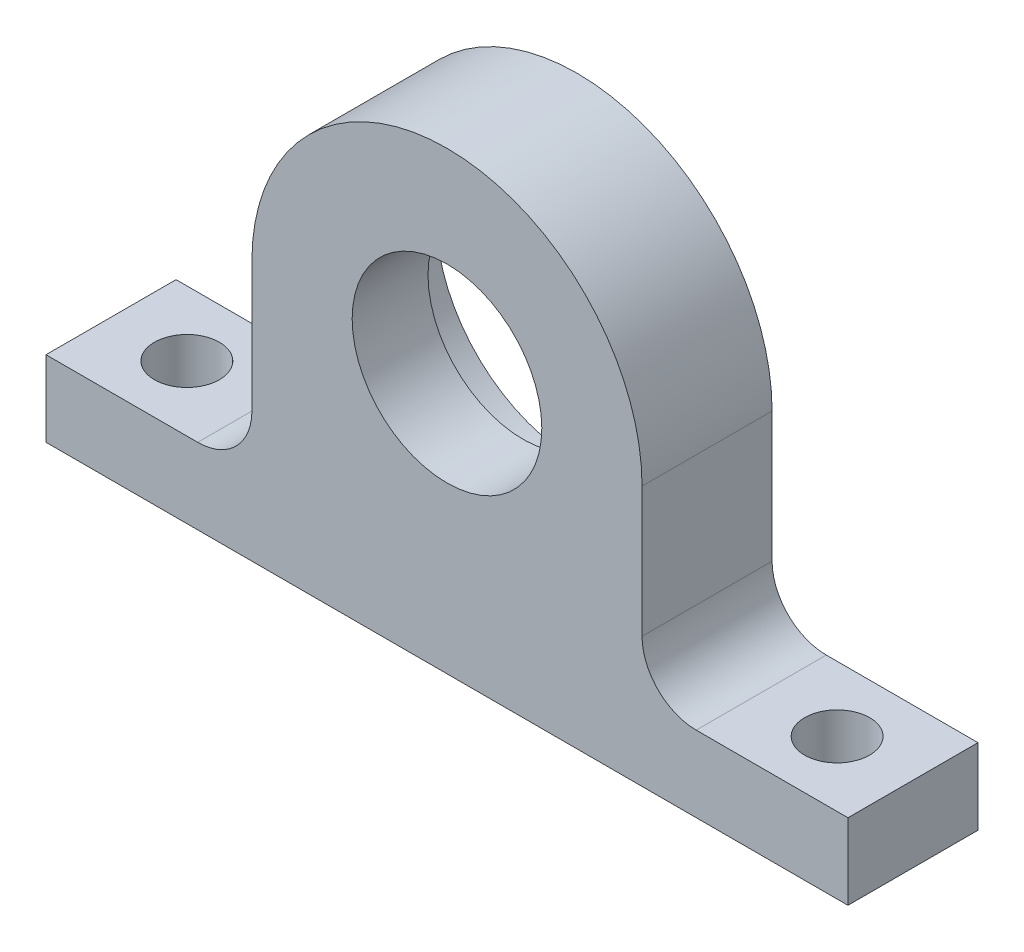
ISO-10303-21;
HEADER;
FILE_DESCRIPTION(('STEP AP214'),'2;1');
FILE_NAME('part.step','',(''),(''),'','','');
FILE_SCHEMA(('AUTOMOTIVE_DESIGN { 1 0 10303 214 1 1 1 1 }'));
ENDSEC;
DATA;
#1=APPLICATION_CONTEXT('core data for automotive mechanical design processes');
#2=APPLICATION_PROTOCOL_DEFINITION('international standard','automotive_design',2000,#1);
#3=PRODUCT_CONTEXT('',#1,'mechanical');
#4=PRODUCT('Part','Part','',(#3));
#5=PRODUCT_RELATED_PRODUCT_CATEGORY('part','',(#4));
#6=PRODUCT_DEFINITION_FORMATION('','',#4);
#7=PRODUCT_DEFINITION_CONTEXT('part definition',#1,'design');
#8=PRODUCT_DEFINITION('design','',#6,#7);
#9=PRODUCT_DEFINITION_SHAPE('','',#8);
#10=(LENGTH_UNIT() NAMED_UNIT(*) SI_UNIT(.MILLI.,.METRE.));
#11=(NAMED_UNIT(*) PLANE_ANGLE_UNIT() SI_UNIT($,.RADIAN.));
#12=(NAMED_UNIT(*) SI_UNIT($,.STERADIAN.) SOLID_ANGLE_UNIT());
#13=UNCERTAINTY_MEASURE_WITH_UNIT(LENGTH_MEASURE(1.E-05),#10,'distance_accuracy_value','');
#14=(GEOMETRIC_REPRESENTATION_CONTEXT(3) GLOBAL_UNCERTAINTY_ASSIGNED_CONTEXT((#13)) GLOBAL_UNIT_ASSIGNED_CONTEXT((#10,
#11,#12)) REPRESENTATION_CONTEXT('',''));
#15=CARTESIAN_POINT('',(0.,0.,0.));
#16=DIRECTION('',(0.,0.,1.));
#17=DIRECTION('',(1.,0.,0.));
#18=AXIS2_PLACEMENT_3D('',#15,#16,#17);
#19=CARTESIAN_POINT('',(0.,0.,12.));
#20=DIRECTION('',(0.,0.,-1.));
#21=DIRECTION('',(-1.,0.,0.));
#22=AXIS2_PLACEMENT_3D('',#19,#20,#21);
#23=CYLINDRICAL_SURFACE('',#22,18.);
#24=CARTESIAN_POINT('',(0.,0.,12.));
#25=DIRECTION('',(0.,0.,1.));
#26=DIRECTION('',(1.,0.,0.));
#27=AXIS2_PLACEMENT_3D('',#24,#25,#26);
#28=CIRCLE('',#27,18.);
#29=CARTESIAN_POINT('',(18.,-1.28369537222284E-13,12.));
#30=VERTEX_POINT('',#29);
#31=CARTESIAN_POINT('',(-18.,-1.31838984174237E-13,12.));
#32=VERTEX_POINT('',#31);
#33=EDGE_CURVE('E122',#30,#32,#28,.T.);
#34=ORIENTED_EDGE('',*,*,#33,.F.);
#35=DIRECTION('',(0.,0.,-1.));
#36=VECTOR('',#35,1.);
#37=CARTESIAN_POINT('',(18.,-1.25693328198353E-13,12.));
#38=LINE('',#37,#36);
#39=CARTESIAN_POINT('',(18.,-1.28369537222284E-13,0.));
#40=VERTEX_POINT('',#39);
#41=EDGE_CURVE('E193',#30,#40,#38,.T.);
#42=ORIENTED_EDGE('',*,*,#41,.T.);
#43=CARTESIAN_POINT('',(0.,0.,0.));
#44=DIRECTION('',(0.,0.,1.));
#45=DIRECTION('',(1.,0.,0.));
#46=AXIS2_PLACEMENT_3D('',#43,#44,#45);
#47=CIRCLE('',#46,18.);
#48=CARTESIAN_POINT('',(-18.,-1.31838984174237E-13,0.));
#49=VERTEX_POINT('',#48);
#50=EDGE_CURVE('E226',#40,#49,#47,.T.);
#51=ORIENTED_EDGE('',*,*,#50,.T.);
#52=DIRECTION('',(0.,0.,-1.));
#53=VECTOR('',#52,1.);
#54=CARTESIAN_POINT('',(-18.,-1.25693328198353E-13,12.));
#55=LINE('',#54,#53);
#56=EDGE_CURVE('E192',#32,#49,#55,.T.);
#57=ORIENTED_EDGE('',*,*,#56,.F.);
#58=EDGE_LOOP('',(#34,#42,#51,#57));
#59=FACE_BOUND('',#58,.T.);
#60=ADVANCED_FACE('F41',(#59),#23,.T.);
#61=CARTESIAN_POINT('',(0.,0.,12.));
#62=DIRECTION('',(0.,0.,-1.));
#63=DIRECTION('',(-1.,0.,0.));
#64=AXIS2_PLACEMENT_3D('',#61,#62,#63);
#65=CYLINDRICAL_SURFACE('',#64,8.75);
#66=CARTESIAN_POINT('',(0.,0.,12.));
#67=DIRECTION('',(0.,0.,1.));
#68=DIRECTION('',(1.,0.,0.));
#69=AXIS2_PLACEMENT_3D('',#66,#67,#68);
#70=CIRCLE('',#69,8.75);
#71=CARTESIAN_POINT('',(8.75,0.,12.));
#72=VERTEX_POINT('',#71);
#73=EDGE_CURVE('E214',#72,#72,#70,.T.);
#74=ORIENTED_EDGE('',*,*,#73,.T.);
#75=EDGE_LOOP('',(#74));
#76=FACE_BOUND('',#75,.T.);
#77=CARTESIAN_POINT('',(0.,0.,5.));
#78=DIRECTION('',(0.,0.,-1.));
#79=DIRECTION('',(-1.,0.,0.));
#80=AXIS2_PLACEMENT_3D('',#77,#78,#79);
#81=CIRCLE('',#80,8.75);
#82=CARTESIAN_POINT('',(-8.75,0.,5.));
#83=VERTEX_POINT('',#82);
#84=EDGE_CURVE('E150',#83,#83,#81,.T.);
#85=ORIENTED_EDGE('',*,*,#84,.T.);
#86=EDGE_LOOP('',(#85));
#87=FACE_BOUND('',#86,.T.);
#88=ADVANCED_FACE('F251',(#76,#87),#65,.F.);
#89=CARTESIAN_POINT('',(0.,0.,12.));
#90=DIRECTION('',(0.,0.,1.));
#91=DIRECTION('',(1.,0.,0.));
#92=AXIS2_PLACEMENT_3D('',#89,#90,#91);
#93=PLANE('',#92);
#94=DIRECTION('',(0.,-1.,0.));
#95=VECTOR('',#94,1.);
#96=CARTESIAN_POINT('',(18.,-1.25693328198353E-13,12.));
#97=LINE('',#96,#95);
#98=CARTESIAN_POINT('',(18.,-12.,12.));
#99=VERTEX_POINT('',#98);
#100=EDGE_CURVE('E196',#30,#99,#97,.T.);
#101=ORIENTED_EDGE('',*,*,#100,.F.);
#102=ORIENTED_EDGE('',*,*,#33,.T.);
#103=DIRECTION('',(0.,1.,0.));
#104=VECTOR('',#103,1.);
#105=CARTESIAN_POINT('',(-18.,-1.25693328198353E-13,12.));
#106=LINE('',#105,#104);
#107=CARTESIAN_POINT('',(-18.,-12.,12.));
#108=VERTEX_POINT('',#107);
#109=EDGE_CURVE('E169',#108,#32,#106,.T.);
#110=ORIENTED_EDGE('',*,*,#109,.F.);
#111=CARTESIAN_POINT('',(-23.,-12.,12.));
#112=DIRECTION('',(0.,0.,1.));
#113=DIRECTION('',(1.,0.,0.));
#114=AXIS2_PLACEMENT_3D('',#111,#112,#113);
#115=CIRCLE('',#114,5.);
#116=CARTESIAN_POINT('',(-23.,-17.,12.));
#117=VERTEX_POINT('',#116);
#118=EDGE_CURVE('E162',#108,#117,#115,.F.);
#119=ORIENTED_EDGE('',*,*,#118,.T.);
#120=DIRECTION('',(-1.,0.,0.));
#121=VECTOR('',#120,1.);
#122=CARTESIAN_POINT('',(-5.91607978309961,-17.,12.));
#123=LINE('',#122,#121);
#124=CARTESIAN_POINT('',(-37.,-17.,12.));
#125=VERTEX_POINT('',#124);
#126=EDGE_CURVE('E166',#117,#125,#123,.T.);
#127=ORIENTED_EDGE('',*,*,#126,.T.);
#128=DIRECTION('',(0.,-1.,0.));
#129=VECTOR('',#128,1.);
#130=CARTESIAN_POINT('',(-37.,-17.,12.));
#131=LINE('',#130,#129);
#132=CARTESIAN_POINT('',(-37.,-24.,12.));
#133=VERTEX_POINT('',#132);
#134=EDGE_CURVE('E177',#125,#133,#131,.T.);
#135=ORIENTED_EDGE('',*,*,#134,.T.);
#136=DIRECTION('',(1.,0.,0.));
#137=VECTOR('',#136,1.);
#138=CARTESIAN_POINT('',(-37.,-24.,12.));
#139=LINE('',#138,#137);
#140=CARTESIAN_POINT('',(37.,-24.,12.));
#141=VERTEX_POINT('',#140);
#142=EDGE_CURVE('E130',#133,#141,#139,.T.);
#143=ORIENTED_EDGE('',*,*,#142,.T.);
#144=DIRECTION('',(0.,1.,0.));
#145=VECTOR('',#144,1.);
#146=CARTESIAN_POINT('',(37.,-17.,12.));
#147=LINE('',#146,#145);
#148=CARTESIAN_POINT('',(37.,-17.,12.));
#149=VERTEX_POINT('',#148);
#150=EDGE_CURVE('E123',#141,#149,#147,.T.);
#151=ORIENTED_EDGE('',*,*,#150,.T.);
#152=DIRECTION('',(-1.,0.,0.));
#153=VECTOR('',#152,1.);
#154=CARTESIAN_POINT('',(5.91607978309961,-17.,12.));
#155=LINE('',#154,#153);
#156=CARTESIAN_POINT('',(23.,-17.,12.));
#157=VERTEX_POINT('',#156);
#158=EDGE_CURVE('E114',#149,#157,#155,.T.);
#159=ORIENTED_EDGE('',*,*,#158,.T.);
#160=CARTESIAN_POINT('',(23.,-12.,12.));
#161=DIRECTION('',(0.,0.,1.));
#162=DIRECTION('',(1.,0.,0.));
#163=AXIS2_PLACEMENT_3D('',#160,#161,#162);
#164=CIRCLE('',#163,5.);
#165=EDGE_CURVE('E11',#157,#99,#164,.F.);
#166=ORIENTED_EDGE('',*,*,#165,.T.);
#167=EDGE_LOOP('',(#101,#102,#110,#119,#127,#135,#143,#151,#159,#166));
#168=FACE_BOUND('',#167,.T.);
#169=ORIENTED_EDGE('',*,*,#73,.F.);
#170=EDGE_LOOP('',(#169));
#171=FACE_BOUND('',#170,.T.);
#172=ADVANCED_FACE('F127',(#168,#171),#93,.T.);
#173=CARTESIAN_POINT('',(0.,0.,0.));
#174=DIRECTION('',(0.,0.,1.));
#175=DIRECTION('',(1.,0.,0.));
#176=AXIS2_PLACEMENT_3D('',#173,#174,#175);
#177=PLANE('',#176);
#178=ORIENTED_EDGE('',*,*,#50,.F.);
#179=DIRECTION('',(0.,-1.,0.));
#180=VECTOR('',#179,1.);
#181=CARTESIAN_POINT('',(18.,-1.25693328198353E-13,0.));
#182=LINE('',#181,#180);
#183=CARTESIAN_POINT('',(18.,-12.,0.));
#184=VERTEX_POINT('',#183);
#185=EDGE_CURVE('E246',#40,#184,#182,.T.);
#186=ORIENTED_EDGE('',*,*,#185,.T.);
#187=CARTESIAN_POINT('',(23.,-12.,0.));
#188=DIRECTION('',(0.,0.,1.));
#189=DIRECTION('',(1.,0.,0.));
#190=AXIS2_PLACEMENT_3D('',#187,#188,#189);
#191=CIRCLE('',#190,5.);
#192=CARTESIAN_POINT('',(23.,-17.,0.));
#193=VERTEX_POINT('',#192);
#194=EDGE_CURVE('E49',#184,#193,#191,.T.);
#195=ORIENTED_EDGE('',*,*,#194,.T.);
#196=DIRECTION('',(-1.,0.,0.));
#197=VECTOR('',#196,1.);
#198=CARTESIAN_POINT('',(5.91607978309961,-17.,0.));
#199=LINE('',#198,#197);
#200=CARTESIAN_POINT('',(37.,-17.,0.));
#201=VERTEX_POINT('',#200);
#202=EDGE_CURVE('E224',#201,#193,#199,.T.);
#203=ORIENTED_EDGE('',*,*,#202,.F.);
#204=DIRECTION('',(0.,1.,0.));
#205=VECTOR('',#204,1.);
#206=CARTESIAN_POINT('',(37.,-17.,0.));
#207=LINE('',#206,#205);
#208=CARTESIAN_POINT('',(37.,-24.,0.));
#209=VERTEX_POINT('',#208);
#210=EDGE_CURVE('E138',#209,#201,#207,.T.);
#211=ORIENTED_EDGE('',*,*,#210,.F.);
#212=DIRECTION('',(1.,0.,0.));
#213=VECTOR('',#212,1.);
#214=CARTESIAN_POINT('',(37.,-24.,0.));
#215=LINE('',#214,#213);
#216=CARTESIAN_POINT('',(-37.,-24.,0.));
#217=VERTEX_POINT('',#216);
#218=EDGE_CURVE('E134',#217,#209,#215,.T.);
#219=ORIENTED_EDGE('',*,*,#218,.F.);
#220=DIRECTION('',(0.,-1.,0.));
#221=VECTOR('',#220,1.);
#222=CARTESIAN_POINT('',(-37.,-17.,0.));
#223=LINE('',#222,#221);
#224=CARTESIAN_POINT('',(-37.,-17.,0.));
#225=VERTEX_POINT('',#224);
#226=EDGE_CURVE('E229',#225,#217,#223,.T.);
#227=ORIENTED_EDGE('',*,*,#226,.F.);
#228=DIRECTION('',(-1.,0.,0.));
#229=VECTOR('',#228,1.);
#230=CARTESIAN_POINT('',(-5.91607978309961,-17.,0.));
#231=LINE('',#230,#229);
#232=CARTESIAN_POINT('',(-23.,-17.,0.));
#233=VERTEX_POINT('',#232);
#234=EDGE_CURVE('E187',#233,#225,#231,.T.);
#235=ORIENTED_EDGE('',*,*,#234,.F.);
#236=CARTESIAN_POINT('',(-23.,-12.,0.));
#237=DIRECTION('',(0.,0.,1.));
#238=DIRECTION('',(1.,0.,0.));
#239=AXIS2_PLACEMENT_3D('',#236,#237,#238);
#240=CIRCLE('',#239,5.);
#241=CARTESIAN_POINT('',(-18.,-12.,0.));
#242=VERTEX_POINT('',#241);
#243=EDGE_CURVE('E160',#233,#242,#240,.T.);
#244=ORIENTED_EDGE('',*,*,#243,.T.);
#245=DIRECTION('',(0.,1.,0.));
#246=VECTOR('',#245,1.);
#247=CARTESIAN_POINT('',(-18.,-1.25693328198353E-13,0.));
#248=LINE('',#247,#246);
#249=EDGE_CURVE('E184',#242,#49,#248,.T.);
#250=ORIENTED_EDGE('',*,*,#249,.T.);
#251=EDGE_LOOP('',(#178,#186,#195,#203,#211,#219,#227,#235,#244,#250));
#252=FACE_BOUND('',#251,.T.);
#253=CARTESIAN_POINT('',(0.,0.,0.));
#254=DIRECTION('',(0.,0.,-1.));
#255=DIRECTION('',(-1.,0.,0.));
#256=AXIS2_PLACEMENT_3D('',#253,#254,#255);
#257=CIRCLE('',#256,13.);
#258=CARTESIAN_POINT('',(-13.,0.,0.));
#259=VERTEX_POINT('',#258);
#260=EDGE_CURVE('E200',#259,#259,#257,.T.);
#261=ORIENTED_EDGE('',*,*,#260,.F.);
#262=EDGE_LOOP('',(#261));
#263=FACE_BOUND('',#262,.T.);
#264=ADVANCED_FACE('F182',(#252,#263),#177,.F.);
#265=CARTESIAN_POINT('',(37.,-17.,12.));
#266=DIRECTION('',(-1.,0.,0.));
#267=DIRECTION('',(0.,-1.,0.));
#268=AXIS2_PLACEMENT_3D('',#265,#266,#267);
#269=PLANE('',#268);
#270=ORIENTED_EDGE('',*,*,#210,.T.);
#271=DIRECTION('',(0.,0.,-1.));
#272=VECTOR('',#271,1.);
#273=CARTESIAN_POINT('',(37.,-17.,12.));
#274=LINE('',#273,#272);
#275=EDGE_CURVE('E118',#149,#201,#274,.T.);
#276=ORIENTED_EDGE('',*,*,#275,.F.);
#277=ORIENTED_EDGE('',*,*,#150,.F.);
#278=DIRECTION('',(0.,0.,-1.));
#279=VECTOR('',#278,1.);
#280=CARTESIAN_POINT('',(37.,-24.,12.));
#281=LINE('',#280,#279);
#282=EDGE_CURVE('E222',#141,#209,#281,.T.);
#283=ORIENTED_EDGE('',*,*,#282,.T.);
#284=EDGE_LOOP('',(#270,#276,#277,#283));
#285=FACE_BOUND('',#284,.T.);
#286=ADVANCED_FACE('F136',(#285),#269,.F.);
#287=CARTESIAN_POINT('',(5.91607978309961,-17.,12.));
#288=DIRECTION('',(0.,-1.,0.));
#289=DIRECTION('',(1.,0.,0.));
#290=AXIS2_PLACEMENT_3D('',#287,#288,#289);
#291=PLANE('',#290);
#292=CARTESIAN_POINT('',(30.,-17.,6.));
#293=DIRECTION('',(0.,1.,0.));
#294=DIRECTION('',(-1.,0.,0.));
#295=AXIS2_PLACEMENT_3D('',#292,#293,#294);
#296=CIRCLE('',#295,3.);
#297=CARTESIAN_POINT('',(27.,-17.,6.));
#298=VERTEX_POINT('',#297);
#299=EDGE_CURVE('E208',#298,#298,#296,.T.);
#300=ORIENTED_EDGE('',*,*,#299,.F.);
#301=EDGE_LOOP('',(#300));
#302=FACE_BOUND('',#301,.T.);
#303=ORIENTED_EDGE('',*,*,#202,.T.);
#304=DIRECTION('',(0.,0.,-1.));
#305=VECTOR('',#304,1.);
#306=CARTESIAN_POINT('',(23.,-17.,12.));
#307=LINE('',#306,#305);
#308=EDGE_CURVE('E56',#193,#157,#307,.F.);
#309=ORIENTED_EDGE('',*,*,#308,.T.);
#310=ORIENTED_EDGE('',*,*,#158,.F.);
#311=ORIENTED_EDGE('',*,*,#275,.T.);
#312=EDGE_LOOP('',(#303,#309,#310,#311));
#313=FACE_BOUND('',#312,.T.);
#314=ADVANCED_FACE('F116',(#302,#313),#291,.F.);
#315=CARTESIAN_POINT('',(-5.91607978309961,-17.,12.));
#316=DIRECTION('',(0.,-1.,0.));
#317=DIRECTION('',(1.,0.,0.));
#318=AXIS2_PLACEMENT_3D('',#315,#316,#317);
#319=PLANE('',#318);
#320=CARTESIAN_POINT('',(-30.,-17.,6.));
#321=DIRECTION('',(0.,1.,0.));
#322=DIRECTION('',(1.,0.,0.));
#323=AXIS2_PLACEMENT_3D('',#320,#321,#322);
#324=CIRCLE('',#323,3.);
#325=CARTESIAN_POINT('',(-27.,-17.,6.));
#326=VERTEX_POINT('',#325);
#327=EDGE_CURVE('E152',#326,#326,#324,.T.);
#328=ORIENTED_EDGE('',*,*,#327,.F.);
#329=EDGE_LOOP('',(#328));
#330=FACE_BOUND('',#329,.T.);
#331=ORIENTED_EDGE('',*,*,#126,.F.);
#332=DIRECTION('',(0.,0.,-1.));
#333=VECTOR('',#332,1.);
#334=CARTESIAN_POINT('',(-23.,-17.,12.));
#335=LINE('',#334,#333);
#336=EDGE_CURVE('E139',#117,#233,#335,.T.);
#337=ORIENTED_EDGE('',*,*,#336,.T.);
#338=ORIENTED_EDGE('',*,*,#234,.T.);
#339=DIRECTION('',(0.,0.,-1.));
#340=VECTOR('',#339,1.);
#341=CARTESIAN_POINT('',(-37.,-17.,12.));
#342=LINE('',#341,#340);
#343=EDGE_CURVE('E140',#125,#225,#342,.T.);
#344=ORIENTED_EDGE('',*,*,#343,.F.);
#345=EDGE_LOOP('',(#331,#337,#338,#344));
#346=FACE_BOUND('',#345,.T.);
#347=ADVANCED_FACE('F174',(#330,#346),#319,.F.);
#348=CARTESIAN_POINT('',(-37.,-17.,12.));
#349=DIRECTION('',(1.,0.,0.));
#350=DIRECTION('',(0.,1.,0.));
#351=AXIS2_PLACEMENT_3D('',#348,#349,#350);
#352=PLANE('',#351);
#353=ORIENTED_EDGE('',*,*,#226,.T.);
#354=DIRECTION('',(0.,0.,-1.));
#355=VECTOR('',#354,1.);
#356=CARTESIAN_POINT('',(-37.,-24.,12.));
#357=LINE('',#356,#355);
#358=EDGE_CURVE('E146',#133,#217,#357,.T.);
#359=ORIENTED_EDGE('',*,*,#358,.F.);
#360=ORIENTED_EDGE('',*,*,#134,.F.);
#361=ORIENTED_EDGE('',*,*,#343,.T.);
#362=EDGE_LOOP('',(#353,#359,#360,#361));
#363=FACE_BOUND('',#362,.T.);
#364=ADVANCED_FACE('F238',(#363),#352,.F.);
#365=CARTESIAN_POINT('',(37.,-24.,12.));
#366=DIRECTION('',(0.,1.,0.));
#367=DIRECTION('',(0.,0.,1.));
#368=AXIS2_PLACEMENT_3D('',#365,#366,#367);
#369=PLANE('',#368);
#370=CARTESIAN_POINT('',(-30.,-24.,6.));
#371=DIRECTION('',(0.,1.,0.));
#372=DIRECTION('',(1.,0.,0.));
#373=AXIS2_PLACEMENT_3D('',#370,#371,#372);
#374=CIRCLE('',#373,3.);
#375=CARTESIAN_POINT('',(-27.,-24.,6.));
#376=VERTEX_POINT('',#375);
#377=EDGE_CURVE('E205',#376,#376,#374,.T.);
#378=ORIENTED_EDGE('',*,*,#377,.T.);
#379=EDGE_LOOP('',(#378));
#380=FACE_BOUND('',#379,.T.);
#381=CARTESIAN_POINT('',(30.,-24.,6.));
#382=DIRECTION('',(0.,1.,0.));
#383=DIRECTION('',(-1.,0.,0.));
#384=AXIS2_PLACEMENT_3D('',#381,#382,#383);
#385=CIRCLE('',#384,3.);
#386=CARTESIAN_POINT('',(27.,-24.,6.));
#387=VERTEX_POINT('',#386);
#388=EDGE_CURVE('E211',#387,#387,#385,.T.);
#389=ORIENTED_EDGE('',*,*,#388,.T.);
#390=EDGE_LOOP('',(#389));
#391=FACE_BOUND('',#390,.T.);
#392=ORIENTED_EDGE('',*,*,#218,.T.);
#393=ORIENTED_EDGE('',*,*,#282,.F.);
#394=ORIENTED_EDGE('',*,*,#142,.F.);
#395=ORIENTED_EDGE('',*,*,#358,.T.);
#396=EDGE_LOOP('',(#392,#393,#394,#395));
#397=FACE_BOUND('',#396,.T.);
#398=ADVANCED_FACE('F236',(#380,#391,#397),#369,.F.);
#399=CARTESIAN_POINT('',(30.,-24.,6.));
#400=DIRECTION('',(0.,1.,0.));
#401=DIRECTION('',(-1.,0.,0.));
#402=AXIS2_PLACEMENT_3D('',#399,#400,#401);
#403=CYLINDRICAL_SURFACE('',#402,3.);
#404=ORIENTED_EDGE('',*,*,#388,.F.);
#405=EDGE_LOOP('',(#404));
#406=FACE_BOUND('',#405,.T.);
#407=ORIENTED_EDGE('',*,*,#299,.T.);
#408=EDGE_LOOP('',(#407));
#409=FACE_BOUND('',#408,.T.);
#410=ADVANCED_FACE('F288',(#406,#409),#403,.F.);
#411=CARTESIAN_POINT('',(-30.,-24.,6.));
#412=DIRECTION('',(0.,1.,0.));
#413=DIRECTION('',(-1.,0.,0.));
#414=AXIS2_PLACEMENT_3D('',#411,#412,#413);
#415=CYLINDRICAL_SURFACE('',#414,3.);
#416=ORIENTED_EDGE('',*,*,#377,.F.);
#417=EDGE_LOOP('',(#416));
#418=FACE_BOUND('',#417,.T.);
#419=ORIENTED_EDGE('',*,*,#327,.T.);
#420=EDGE_LOOP('',(#419));
#421=FACE_BOUND('',#420,.T.);
#422=ADVANCED_FACE('F284',(#418,#421),#415,.F.);
#423=CARTESIAN_POINT('',(0.,0.,5.));
#424=DIRECTION('',(0.,0.,-1.));
#425=DIRECTION('',(-1.,0.,0.));
#426=AXIS2_PLACEMENT_3D('',#423,#424,#425);
#427=CYLINDRICAL_SURFACE('',#426,13.);
#428=CARTESIAN_POINT('',(0.,0.,5.));
#429=DIRECTION('',(0.,0.,-1.));
#430=DIRECTION('',(-1.,0.,0.));
#431=AXIS2_PLACEMENT_3D('',#428,#429,#430);
#432=CIRCLE('',#431,13.);
#433=CARTESIAN_POINT('',(-13.,0.,5.));
#434=VERTEX_POINT('',#433);
#435=EDGE_CURVE('E153',#434,#434,#432,.T.);
#436=ORIENTED_EDGE('',*,*,#435,.F.);
#437=EDGE_LOOP('',(#436));
#438=FACE_BOUND('',#437,.T.);
#439=ORIENTED_EDGE('',*,*,#260,.T.);
#440=EDGE_LOOP('',(#439));
#441=FACE_BOUND('',#440,.T.);
#442=ADVANCED_FACE('F280',(#438,#441),#427,.F.);
#443=CARTESIAN_POINT('',(0.,0.,5.));
#444=DIRECTION('',(0.,0.,-1.));
#445=DIRECTION('',(-1.,0.,0.));
#446=AXIS2_PLACEMENT_3D('',#443,#444,#445);
#447=PLANE('',#446);
#448=ORIENTED_EDGE('',*,*,#84,.F.);
#449=EDGE_LOOP('',(#448));
#450=FACE_BOUND('',#449,.T.);
#451=ORIENTED_EDGE('',*,*,#435,.T.);
#452=EDGE_LOOP('',(#451));
#453=FACE_BOUND('',#452,.T.);
#454=ADVANCED_FACE('F276',(#450,#453),#447,.T.);
#455=CARTESIAN_POINT('',(-18.,-1.25693328198353E-13,12.));
#456=DIRECTION('',(-1.,0.,0.));
#457=DIRECTION('',(0.,-1.,0.));
#458=AXIS2_PLACEMENT_3D('',#455,#456,#457);
#459=PLANE('',#458);
#460=ORIENTED_EDGE('',*,*,#249,.F.);
#461=DIRECTION('',(0.,0.,-1.));
#462=VECTOR('',#461,1.);
#463=CARTESIAN_POINT('',(-18.,-12.,12.));
#464=LINE('',#463,#462);
#465=EDGE_CURVE('E143',#242,#108,#464,.F.);
#466=ORIENTED_EDGE('',*,*,#465,.T.);
#467=ORIENTED_EDGE('',*,*,#109,.T.);
#468=ORIENTED_EDGE('',*,*,#56,.T.);
#469=EDGE_LOOP('',(#460,#466,#467,#468));
#470=FACE_BOUND('',#469,.T.);
#471=ADVANCED_FACE('F190',(#470),#459,.T.);
#472=CARTESIAN_POINT('',(18.,-1.25693328198353E-13,12.));
#473=DIRECTION('',(1.,0.,0.));
#474=DIRECTION('',(0.,1.,0.));
#475=AXIS2_PLACEMENT_3D('',#472,#473,#474);
#476=PLANE('',#475);
#477=ORIENTED_EDGE('',*,*,#100,.T.);
#478=DIRECTION('',(0.,0.,-1.));
#479=VECTOR('',#478,1.);
#480=CARTESIAN_POINT('',(18.,-12.,12.));
#481=LINE('',#480,#479);
#482=EDGE_CURVE('E156',#99,#184,#481,.T.);
#483=ORIENTED_EDGE('',*,*,#482,.T.);
#484=ORIENTED_EDGE('',*,*,#185,.F.);
#485=ORIENTED_EDGE('',*,*,#41,.F.);
#486=EDGE_LOOP('',(#477,#483,#484,#485));
#487=FACE_BOUND('',#486,.T.);
#488=ADVANCED_FACE('F244',(#487),#476,.T.);
#489=CARTESIAN_POINT('',(-23.,-12.,12.));
#490=DIRECTION('',(0.,0.,-1.));
#491=DIRECTION('',(-1.,0.,0.));
#492=AXIS2_PLACEMENT_3D('',#489,#490,#491);
#493=CYLINDRICAL_SURFACE('',#492,5.);
#494=ORIENTED_EDGE('',*,*,#118,.F.);
#495=ORIENTED_EDGE('',*,*,#465,.F.);
#496=ORIENTED_EDGE('',*,*,#243,.F.);
#497=ORIENTED_EDGE('',*,*,#336,.F.);
#498=EDGE_LOOP('',(#494,#495,#496,#497));
#499=FACE_BOUND('',#498,.T.);
#500=ADVANCED_FACE('F179',(#499),#493,.F.);
#501=CARTESIAN_POINT('',(23.,-12.,12.));
#502=DIRECTION('',(0.,0.,-1.));
#503=DIRECTION('',(-1.,0.,0.));
#504=AXIS2_PLACEMENT_3D('',#501,#502,#503);
#505=CYLINDRICAL_SURFACE('',#504,5.);
#506=ORIENTED_EDGE('',*,*,#165,.F.);
#507=ORIENTED_EDGE('',*,*,#308,.F.);
#508=ORIENTED_EDGE('',*,*,#194,.F.);
#509=ORIENTED_EDGE('',*,*,#482,.F.);
#510=EDGE_LOOP('',(#506,#507,#508,#509));
#511=FACE_BOUND('',#510,.T.);
#512=ADVANCED_FACE('F43',(#511),#505,.F.);
#513=CLOSED_SHELL('',(#60,#88,#172,#264,#286,#314,#347,#364,#398,#410,#422,#442,#454,#471,#488,
#500,#512));
#514=MANIFOLD_SOLID_BREP('B2',#513);
#515=ADVANCED_BREP_SHAPE_REPRESENTATION('',(#18,#514),#14);
#516=SHAPE_DEFINITION_REPRESENTATION(#9,#515);
ENDSEC;
END-ISO-10303-21;
